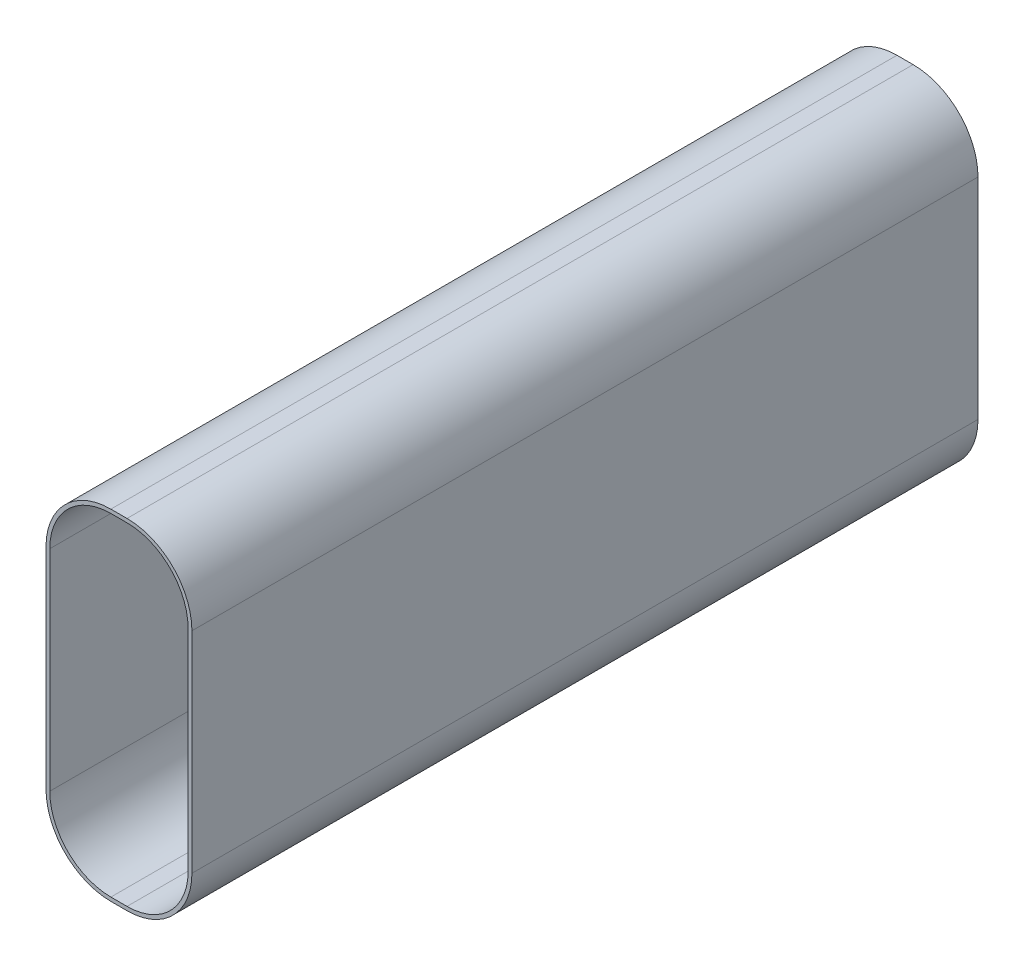
ISO-10303-21;
HEADER;
FILE_DESCRIPTION(('STEP AP214'),'2;1');
FILE_NAME('part.step','',(''),(''),'','','');
FILE_SCHEMA(('AUTOMOTIVE_DESIGN { 1 0 10303 214 1 1 1 1 }'));
ENDSEC;
DATA;
#1=APPLICATION_CONTEXT('core data for automotive mechanical design processes');
#2=APPLICATION_PROTOCOL_DEFINITION('international standard','automotive_design',2000,#1);
#3=PRODUCT_CONTEXT('',#1,'mechanical');
#4=PRODUCT('Part','Part','',(#3));
#5=PRODUCT_RELATED_PRODUCT_CATEGORY('part','',(#4));
#6=PRODUCT_DEFINITION_FORMATION('','',#4);
#7=PRODUCT_DEFINITION_CONTEXT('part definition',#1,'design');
#8=PRODUCT_DEFINITION('design','',#6,#7);
#9=PRODUCT_DEFINITION_SHAPE('','',#8);
#10=(LENGTH_UNIT() NAMED_UNIT(*) SI_UNIT(.MILLI.,.METRE.));
#11=(NAMED_UNIT(*) PLANE_ANGLE_UNIT() SI_UNIT($,.RADIAN.));
#12=(NAMED_UNIT(*) SI_UNIT($,.STERADIAN.) SOLID_ANGLE_UNIT());
#13=UNCERTAINTY_MEASURE_WITH_UNIT(LENGTH_MEASURE(1.E-05),#10,'distance_accuracy_value','');
#14=(GEOMETRIC_REPRESENTATION_CONTEXT(3) GLOBAL_UNCERTAINTY_ASSIGNED_CONTEXT((#13)) GLOBAL_UNIT_ASSIGNED_CONTEXT((#10,
#11,#12)) REPRESENTATION_CONTEXT('',''));
#15=CARTESIAN_POINT('',(0.,0.,0.));
#16=DIRECTION('',(0.,0.,1.));
#17=DIRECTION('',(1.,0.,0.));
#18=AXIS2_PLACEMENT_3D('',#15,#16,#17);
#19=CARTESIAN_POINT('',(0.380999999999987,-4.95299999999999,37.084));
#20=DIRECTION('',(0.,0.,-1.));
#21=DIRECTION('',(-1.,0.,0.));
#22=AXIS2_PLACEMENT_3D('',#19,#20,#21);
#23=PLANE('',#22);
#24=CARTESIAN_POINT('',(0.380999999999987,-4.95299999999999,37.084));
#25=DIRECTION('',(0.,0.,1.));
#26=DIRECTION('',(-1.,0.,0.));
#27=AXIS2_PLACEMENT_3D('',#24,#25,#26);
#28=CIRCLE('',#27,3.06070000000001);
#29=CARTESIAN_POINT('',(0.380999999999988,-8.0137,37.084));
#30=VERTEX_POINT('',#29);
#31=CARTESIAN_POINT('',(3.4417,-4.95299999999999,37.084));
#32=VERTEX_POINT('',#31);
#33=EDGE_CURVE('E217',#30,#32,#28,.T.);
#34=ORIENTED_EDGE('',*,*,#33,.T.);
#35=DIRECTION('',(0.,1.,0.));
#36=VECTOR('',#35,1.);
#37=CARTESIAN_POINT('',(3.4417,4.95299999999999,37.084));
#38=LINE('',#37,#36);
#39=CARTESIAN_POINT('',(3.4417,4.95299999999999,37.084));
#40=VERTEX_POINT('',#39);
#41=EDGE_CURVE('E220',#32,#40,#38,.T.);
#42=ORIENTED_EDGE('',*,*,#41,.T.);
#43=CARTESIAN_POINT('',(0.380999999999987,4.95299999999999,37.084));
#44=DIRECTION('',(0.,0.,1.));
#45=DIRECTION('',(-1.,0.,0.));
#46=AXIS2_PLACEMENT_3D('',#43,#44,#45);
#47=CIRCLE('',#46,3.06070000000001);
#48=CARTESIAN_POINT('',(0.380999999999988,8.0137,37.084));
#49=VERTEX_POINT('',#48);
#50=EDGE_CURVE('E223',#40,#49,#47,.T.);
#51=ORIENTED_EDGE('',*,*,#50,.T.);
#52=DIRECTION('',(-1.,0.,0.));
#53=VECTOR('',#52,1.);
#54=CARTESIAN_POINT('',(0.380999999999988,8.0137,37.084));
#55=LINE('',#54,#53);
#56=CARTESIAN_POINT('',(-0.380999999999988,8.0137,37.084));
#57=VERTEX_POINT('',#56);
#58=EDGE_CURVE('E225',#49,#57,#55,.T.);
#59=ORIENTED_EDGE('',*,*,#58,.T.);
#60=CARTESIAN_POINT('',(-0.380999999999987,4.95299999999999,37.084));
#61=DIRECTION('',(0.,0.,1.));
#62=DIRECTION('',(1.,0.,0.));
#63=AXIS2_PLACEMENT_3D('',#60,#61,#62);
#64=CIRCLE('',#63,3.06070000000001);
#65=CARTESIAN_POINT('',(-3.4417,4.95299999999999,37.084));
#66=VERTEX_POINT('',#65);
#67=EDGE_CURVE('E227',#57,#66,#64,.T.);
#68=ORIENTED_EDGE('',*,*,#67,.T.);
#69=DIRECTION('',(0.,-1.,0.));
#70=VECTOR('',#69,1.);
#71=CARTESIAN_POINT('',(-3.4417,4.95299999999999,37.084));
#72=LINE('',#71,#70);
#73=CARTESIAN_POINT('',(-3.4417,-4.95299999999999,37.084));
#74=VERTEX_POINT('',#73);
#75=EDGE_CURVE('E229',#66,#74,#72,.T.);
#76=ORIENTED_EDGE('',*,*,#75,.T.);
#77=CARTESIAN_POINT('',(-0.380999999999987,-4.95299999999999,37.084));
#78=DIRECTION('',(0.,0.,1.));
#79=DIRECTION('',(1.,0.,0.));
#80=AXIS2_PLACEMENT_3D('',#77,#78,#79);
#81=CIRCLE('',#80,3.06070000000001);
#82=CARTESIAN_POINT('',(-0.380999999999988,-8.0137,37.084));
#83=VERTEX_POINT('',#82);
#84=EDGE_CURVE('E231',#74,#83,#81,.T.);
#85=ORIENTED_EDGE('',*,*,#84,.T.);
#86=DIRECTION('',(1.,0.,0.));
#87=VECTOR('',#86,1.);
#88=CARTESIAN_POINT('',(-0.380999999999988,-8.0137,37.084));
#89=LINE('',#88,#87);
#90=EDGE_CURVE('E233',#83,#30,#89,.T.);
#91=ORIENTED_EDGE('',*,*,#90,.T.);
#92=EDGE_LOOP('',(#34,#42,#51,#59,#68,#76,#85,#91));
#93=FACE_BOUND('',#92,.T.);
#94=CARTESIAN_POINT('',(0.380999999999987,4.95299999999999,37.084));
#95=DIRECTION('',(0.,0.,1.));
#96=DIRECTION('',(-1.,0.,0.));
#97=AXIS2_PLACEMENT_3D('',#94,#95,#96);
#98=CIRCLE('',#97,2.88290000000001);
#99=CARTESIAN_POINT('',(3.2639,4.95299999999999,37.084));
#100=VERTEX_POINT('',#99);
#101=CARTESIAN_POINT('',(0.380999999999988,7.8359,37.084));
#102=VERTEX_POINT('',#101);
#103=EDGE_CURVE('E152',#100,#102,#98,.T.);
#104=ORIENTED_EDGE('',*,*,#103,.F.);
#105=DIRECTION('',(0.,1.,0.));
#106=VECTOR('',#105,1.);
#107=CARTESIAN_POINT('',(3.2639,4.95299999999999,37.084));
#108=LINE('',#107,#106);
#109=CARTESIAN_POINT('',(3.2639,-4.95299999999999,37.084));
#110=VERTEX_POINT('',#109);
#111=EDGE_CURVE('E185',#110,#100,#108,.T.);
#112=ORIENTED_EDGE('',*,*,#111,.F.);
#113=CARTESIAN_POINT('',(0.380999999999987,-4.95299999999999,37.084));
#114=DIRECTION('',(0.,0.,1.));
#115=DIRECTION('',(-1.,0.,0.));
#116=AXIS2_PLACEMENT_3D('',#113,#114,#115);
#117=CIRCLE('',#116,2.88290000000001);
#118=CARTESIAN_POINT('',(0.380999999999988,-7.8359,37.084));
#119=VERTEX_POINT('',#118);
#120=EDGE_CURVE('E183',#119,#110,#117,.T.);
#121=ORIENTED_EDGE('',*,*,#120,.F.);
#122=DIRECTION('',(1.,0.,0.));
#123=VECTOR('',#122,1.);
#124=CARTESIAN_POINT('',(-0.380999999999988,-7.8359,37.084));
#125=LINE('',#124,#123);
#126=CARTESIAN_POINT('',(-0.380999999999988,-7.8359,37.084));
#127=VERTEX_POINT('',#126);
#128=EDGE_CURVE('E181',#127,#119,#125,.T.);
#129=ORIENTED_EDGE('',*,*,#128,.F.);
#130=CARTESIAN_POINT('',(-0.380999999999987,-4.95299999999999,37.084));
#131=DIRECTION('',(0.,0.,1.));
#132=DIRECTION('',(1.,0.,0.));
#133=AXIS2_PLACEMENT_3D('',#130,#131,#132);
#134=CIRCLE('',#133,2.88290000000001);
#135=CARTESIAN_POINT('',(-3.2639,-4.95299999999999,37.084));
#136=VERTEX_POINT('',#135);
#137=EDGE_CURVE('E179',#136,#127,#134,.T.);
#138=ORIENTED_EDGE('',*,*,#137,.F.);
#139=DIRECTION('',(0.,-1.,0.));
#140=VECTOR('',#139,1.);
#141=CARTESIAN_POINT('',(-3.2639,4.95299999999999,37.084));
#142=LINE('',#141,#140);
#143=CARTESIAN_POINT('',(-3.2639,4.95299999999999,37.084));
#144=VERTEX_POINT('',#143);
#145=EDGE_CURVE('E175',#144,#136,#142,.T.);
#146=ORIENTED_EDGE('',*,*,#145,.F.);
#147=CARTESIAN_POINT('',(-0.380999999999987,4.95299999999999,37.084));
#148=DIRECTION('',(0.,0.,1.));
#149=DIRECTION('',(1.,0.,0.));
#150=AXIS2_PLACEMENT_3D('',#147,#148,#149);
#151=CIRCLE('',#150,2.88290000000001);
#152=CARTESIAN_POINT('',(-0.380999999999988,7.8359,37.084));
#153=VERTEX_POINT('',#152);
#154=EDGE_CURVE('E173',#153,#144,#151,.T.);
#155=ORIENTED_EDGE('',*,*,#154,.F.);
#156=DIRECTION('',(-1.,0.,0.));
#157=VECTOR('',#156,1.);
#158=CARTESIAN_POINT('',(0.380999999999988,7.8359,37.084));
#159=LINE('',#158,#157);
#160=EDGE_CURVE('E160',#102,#153,#159,.T.);
#161=ORIENTED_EDGE('',*,*,#160,.F.);
#162=EDGE_LOOP('',(#104,#112,#121,#129,#138,#146,#155,#161));
#163=FACE_BOUND('',#162,.T.);
#164=ADVANCED_FACE('F39',(#93,#163),#23,.F.);
#165=CARTESIAN_POINT('',(0.380999999999987,-4.95299999999999,0.));
#166=DIRECTION('',(0.,0.,-1.));
#167=DIRECTION('',(-1.,0.,0.));
#168=AXIS2_PLACEMENT_3D('',#165,#166,#167);
#169=PLANE('',#168);
#170=CARTESIAN_POINT('',(0.380999999999987,-4.95299999999999,0.));
#171=DIRECTION('',(0.,0.,1.));
#172=DIRECTION('',(-1.,0.,0.));
#173=AXIS2_PLACEMENT_3D('',#170,#171,#172);
#174=CIRCLE('',#173,3.06070000000001);
#175=CARTESIAN_POINT('',(0.380999999999988,-8.0137,0.));
#176=VERTEX_POINT('',#175);
#177=CARTESIAN_POINT('',(3.4417,-4.95299999999999,0.));
#178=VERTEX_POINT('',#177);
#179=EDGE_CURVE('E168',#176,#178,#174,.T.);
#180=ORIENTED_EDGE('',*,*,#179,.F.);
#181=DIRECTION('',(1.,0.,0.));
#182=VECTOR('',#181,1.);
#183=CARTESIAN_POINT('',(-0.380999999999988,-8.0137,0.));
#184=LINE('',#183,#182);
#185=CARTESIAN_POINT('',(-0.380999999999988,-8.0137,0.));
#186=VERTEX_POINT('',#185);
#187=EDGE_CURVE('E221',#186,#176,#184,.T.);
#188=ORIENTED_EDGE('',*,*,#187,.F.);
#189=CARTESIAN_POINT('',(-0.380999999999987,-4.95299999999999,0.));
#190=DIRECTION('',(0.,0.,1.));
#191=DIRECTION('',(1.,0.,0.));
#192=AXIS2_PLACEMENT_3D('',#189,#190,#191);
#193=CIRCLE('',#192,3.06070000000001);
#194=CARTESIAN_POINT('',(-3.4417,-4.95299999999999,0.));
#195=VERTEX_POINT('',#194);
#196=EDGE_CURVE('E248',#195,#186,#193,.T.);
#197=ORIENTED_EDGE('',*,*,#196,.F.);
#198=DIRECTION('',(0.,-1.,0.));
#199=VECTOR('',#198,1.);
#200=CARTESIAN_POINT('',(-3.4417,4.95299999999999,0.));
#201=LINE('',#200,#199);
#202=CARTESIAN_POINT('',(-3.4417,4.95299999999999,0.));
#203=VERTEX_POINT('',#202);
#204=EDGE_CURVE('E246',#203,#195,#201,.T.);
#205=ORIENTED_EDGE('',*,*,#204,.F.);
#206=CARTESIAN_POINT('',(-0.380999999999987,4.95299999999999,0.));
#207=DIRECTION('',(0.,0.,1.));
#208=DIRECTION('',(1.,0.,0.));
#209=AXIS2_PLACEMENT_3D('',#206,#207,#208);
#210=CIRCLE('',#209,3.06070000000001);
#211=CARTESIAN_POINT('',(-0.380999999999988,8.0137,0.));
#212=VERTEX_POINT('',#211);
#213=EDGE_CURVE('E244',#212,#203,#210,.T.);
#214=ORIENTED_EDGE('',*,*,#213,.F.);
#215=DIRECTION('',(-1.,0.,0.));
#216=VECTOR('',#215,1.);
#217=CARTESIAN_POINT('',(0.380999999999988,8.0137,0.));
#218=LINE('',#217,#216);
#219=CARTESIAN_POINT('',(0.380999999999988,8.0137,0.));
#220=VERTEX_POINT('',#219);
#221=EDGE_CURVE('E242',#220,#212,#218,.T.);
#222=ORIENTED_EDGE('',*,*,#221,.F.);
#223=CARTESIAN_POINT('',(0.380999999999987,4.95299999999999,0.));
#224=DIRECTION('',(0.,0.,1.));
#225=DIRECTION('',(-1.,0.,0.));
#226=AXIS2_PLACEMENT_3D('',#223,#224,#225);
#227=CIRCLE('',#226,3.06070000000001);
#228=CARTESIAN_POINT('',(3.4417,4.95299999999999,0.));
#229=VERTEX_POINT('',#228);
#230=EDGE_CURVE('E240',#229,#220,#227,.T.);
#231=ORIENTED_EDGE('',*,*,#230,.F.);
#232=DIRECTION('',(0.,1.,0.));
#233=VECTOR('',#232,1.);
#234=CARTESIAN_POINT('',(3.4417,4.95299999999999,0.));
#235=LINE('',#234,#233);
#236=EDGE_CURVE('E238',#178,#229,#235,.T.);
#237=ORIENTED_EDGE('',*,*,#236,.F.);
#238=EDGE_LOOP('',(#180,#188,#197,#205,#214,#222,#231,#237));
#239=FACE_BOUND('',#238,.T.);
#240=DIRECTION('',(0.,1.,0.));
#241=VECTOR('',#240,1.);
#242=CARTESIAN_POINT('',(3.2639,4.95299999999999,0.));
#243=LINE('',#242,#241);
#244=CARTESIAN_POINT('',(3.2639,-4.95299999999999,0.));
#245=VERTEX_POINT('',#244);
#246=CARTESIAN_POINT('',(3.2639,4.95299999999999,0.));
#247=VERTEX_POINT('',#246);
#248=EDGE_CURVE('E161',#245,#247,#243,.T.);
#249=ORIENTED_EDGE('',*,*,#248,.T.);
#250=CARTESIAN_POINT('',(0.380999999999987,4.95299999999999,0.));
#251=DIRECTION('',(0.,0.,1.));
#252=DIRECTION('',(-1.,0.,0.));
#253=AXIS2_PLACEMENT_3D('',#250,#251,#252);
#254=CIRCLE('',#253,2.88290000000001);
#255=CARTESIAN_POINT('',(0.380999999999988,7.8359,0.));
#256=VERTEX_POINT('',#255);
#257=EDGE_CURVE('E62',#247,#256,#254,.T.);
#258=ORIENTED_EDGE('',*,*,#257,.T.);
#259=DIRECTION('',(-1.,0.,0.));
#260=VECTOR('',#259,1.);
#261=CARTESIAN_POINT('',(0.380999999999988,7.8359,0.));
#262=LINE('',#261,#260);
#263=CARTESIAN_POINT('',(-0.380999999999988,7.8359,0.));
#264=VERTEX_POINT('',#263);
#265=EDGE_CURVE('E167',#256,#264,#262,.T.);
#266=ORIENTED_EDGE('',*,*,#265,.T.);
#267=CARTESIAN_POINT('',(-0.380999999999987,4.95299999999999,0.));
#268=DIRECTION('',(0.,0.,1.));
#269=DIRECTION('',(1.,0.,0.));
#270=AXIS2_PLACEMENT_3D('',#267,#268,#269);
#271=CIRCLE('',#270,2.88290000000001);
#272=CARTESIAN_POINT('',(-3.2639,4.95299999999999,0.));
#273=VERTEX_POINT('',#272);
#274=EDGE_CURVE('E189',#264,#273,#271,.T.);
#275=ORIENTED_EDGE('',*,*,#274,.T.);
#276=DIRECTION('',(0.,-1.,0.));
#277=VECTOR('',#276,1.);
#278=CARTESIAN_POINT('',(-3.2639,4.95299999999999,0.));
#279=LINE('',#278,#277);
#280=CARTESIAN_POINT('',(-3.2639,-4.95299999999999,0.));
#281=VERTEX_POINT('',#280);
#282=EDGE_CURVE('E192',#273,#281,#279,.T.);
#283=ORIENTED_EDGE('',*,*,#282,.T.);
#284=CARTESIAN_POINT('',(-0.380999999999987,-4.95299999999999,0.));
#285=DIRECTION('',(0.,0.,1.));
#286=DIRECTION('',(1.,0.,0.));
#287=AXIS2_PLACEMENT_3D('',#284,#285,#286);
#288=CIRCLE('',#287,2.88290000000001);
#289=CARTESIAN_POINT('',(-0.380999999999988,-7.8359,0.));
#290=VERTEX_POINT('',#289);
#291=EDGE_CURVE('E195',#281,#290,#288,.T.);
#292=ORIENTED_EDGE('',*,*,#291,.T.);
#293=DIRECTION('',(1.,0.,0.));
#294=VECTOR('',#293,1.);
#295=CARTESIAN_POINT('',(-0.380999999999988,-7.8359,0.));
#296=LINE('',#295,#294);
#297=CARTESIAN_POINT('',(0.380999999999988,-7.8359,0.));
#298=VERTEX_POINT('',#297);
#299=EDGE_CURVE('E198',#290,#298,#296,.T.);
#300=ORIENTED_EDGE('',*,*,#299,.T.);
#301=CARTESIAN_POINT('',(0.380999999999987,-4.95299999999999,0.));
#302=DIRECTION('',(0.,0.,1.));
#303=DIRECTION('',(-1.,0.,0.));
#304=AXIS2_PLACEMENT_3D('',#301,#302,#303);
#305=CIRCLE('',#304,2.88290000000001);
#306=EDGE_CURVE('E201',#298,#245,#305,.T.);
#307=ORIENTED_EDGE('',*,*,#306,.T.);
#308=EDGE_LOOP('',(#249,#258,#266,#275,#283,#292,#300,#307));
#309=FACE_BOUND('',#308,.T.);
#310=ADVANCED_FACE('F278',(#239,#309),#169,.T.);
#311=CARTESIAN_POINT('',(0.380999999999987,-4.95299999999999,37.084));
#312=DIRECTION('',(0.,0.,-1.));
#313=DIRECTION('',(-1.,0.,0.));
#314=AXIS2_PLACEMENT_3D('',#311,#312,#313);
#315=CYLINDRICAL_SURFACE('',#314,3.06070000000001);
#316=ORIENTED_EDGE('',*,*,#179,.T.);
#317=DIRECTION('',(0.,0.,-1.));
#318=VECTOR('',#317,1.);
#319=CARTESIAN_POINT('',(3.4417,-4.95299999999999,37.084));
#320=LINE('',#319,#318);
#321=EDGE_CURVE('E11',#32,#178,#320,.T.);
#322=ORIENTED_EDGE('',*,*,#321,.F.);
#323=ORIENTED_EDGE('',*,*,#33,.F.);
#324=DIRECTION('',(0.,0.,-1.));
#325=VECTOR('',#324,1.);
#326=CARTESIAN_POINT('',(0.380999999999988,-8.0137,37.084));
#327=LINE('',#326,#325);
#328=EDGE_CURVE('E235',#30,#176,#327,.T.);
#329=ORIENTED_EDGE('',*,*,#328,.T.);
#330=EDGE_LOOP('',(#316,#322,#323,#329));
#331=FACE_BOUND('',#330,.T.);
#332=ADVANCED_FACE('F41',(#331),#315,.T.);
#333=CARTESIAN_POINT('',(3.4417,4.95299999999999,37.084));
#334=DIRECTION('',(-1.,0.,0.));
#335=DIRECTION('',(0.,0.,1.));
#336=AXIS2_PLACEMENT_3D('',#333,#334,#335);
#337=PLANE('',#336);
#338=ORIENTED_EDGE('',*,*,#236,.T.);
#339=DIRECTION('',(0.,0.,-1.));
#340=VECTOR('',#339,1.);
#341=CARTESIAN_POINT('',(3.4417,4.95299999999999,37.084));
#342=LINE('',#341,#340);
#343=EDGE_CURVE('E47',#40,#229,#342,.T.);
#344=ORIENTED_EDGE('',*,*,#343,.F.);
#345=ORIENTED_EDGE('',*,*,#41,.F.);
#346=ORIENTED_EDGE('',*,*,#321,.T.);
#347=EDGE_LOOP('',(#338,#344,#345,#346));
#348=FACE_BOUND('',#347,.T.);
#349=ADVANCED_FACE('F295',(#348),#337,.F.);
#350=CARTESIAN_POINT('',(0.380999999999987,4.95299999999999,37.084));
#351=DIRECTION('',(0.,0.,-1.));
#352=DIRECTION('',(-1.,0.,0.));
#353=AXIS2_PLACEMENT_3D('',#350,#351,#352);
#354=CYLINDRICAL_SURFACE('',#353,3.06070000000001);
#355=ORIENTED_EDGE('',*,*,#230,.T.);
#356=DIRECTION('',(0.,0.,-1.));
#357=VECTOR('',#356,1.);
#358=CARTESIAN_POINT('',(0.380999999999988,8.0137,37.084));
#359=LINE('',#358,#357);
#360=EDGE_CURVE('E265',#49,#220,#359,.T.);
#361=ORIENTED_EDGE('',*,*,#360,.F.);
#362=ORIENTED_EDGE('',*,*,#50,.F.);
#363=ORIENTED_EDGE('',*,*,#343,.T.);
#364=EDGE_LOOP('',(#355,#361,#362,#363));
#365=FACE_BOUND('',#364,.T.);
#366=ADVANCED_FACE('F272',(#365),#354,.T.);
#367=CARTESIAN_POINT('',(0.380999999999988,8.0137,37.084));
#368=DIRECTION('',(0.,-1.,0.));
#369=DIRECTION('',(0.,0.,-1.));
#370=AXIS2_PLACEMENT_3D('',#367,#368,#369);
#371=PLANE('',#370);
#372=ORIENTED_EDGE('',*,*,#221,.T.);
#373=DIRECTION('',(0.,0.,-1.));
#374=VECTOR('',#373,1.);
#375=CARTESIAN_POINT('',(-0.380999999999988,8.0137,37.084));
#376=LINE('',#375,#374);
#377=EDGE_CURVE('E262',#57,#212,#376,.T.);
#378=ORIENTED_EDGE('',*,*,#377,.F.);
#379=ORIENTED_EDGE('',*,*,#58,.F.);
#380=ORIENTED_EDGE('',*,*,#360,.T.);
#381=EDGE_LOOP('',(#372,#378,#379,#380));
#382=FACE_BOUND('',#381,.T.);
#383=ADVANCED_FACE('F284',(#382),#371,.F.);
#384=CARTESIAN_POINT('',(-0.380999999999987,4.95299999999999,37.084));
#385=DIRECTION('',(0.,0.,-1.));
#386=DIRECTION('',(-1.,0.,0.));
#387=AXIS2_PLACEMENT_3D('',#384,#385,#386);
#388=CYLINDRICAL_SURFACE('',#387,3.06070000000001);
#389=ORIENTED_EDGE('',*,*,#213,.T.);
#390=DIRECTION('',(0.,0.,-1.));
#391=VECTOR('',#390,1.);
#392=CARTESIAN_POINT('',(-3.4417,4.95299999999999,37.084));
#393=LINE('',#392,#391);
#394=EDGE_CURVE('E259',#66,#203,#393,.T.);
#395=ORIENTED_EDGE('',*,*,#394,.F.);
#396=ORIENTED_EDGE('',*,*,#67,.F.);
#397=ORIENTED_EDGE('',*,*,#377,.T.);
#398=EDGE_LOOP('',(#389,#395,#396,#397));
#399=FACE_BOUND('',#398,.T.);
#400=ADVANCED_FACE('F288',(#399),#388,.T.);
#401=CARTESIAN_POINT('',(-3.4417,4.95299999999999,37.084));
#402=DIRECTION('',(1.,0.,0.));
#403=DIRECTION('',(0.,0.,-1.));
#404=AXIS2_PLACEMENT_3D('',#401,#402,#403);
#405=PLANE('',#404);
#406=ORIENTED_EDGE('',*,*,#204,.T.);
#407=DIRECTION('',(0.,0.,-1.));
#408=VECTOR('',#407,1.);
#409=CARTESIAN_POINT('',(-3.4417,-4.95299999999999,37.084));
#410=LINE('',#409,#408);
#411=EDGE_CURVE('E256',#74,#195,#410,.T.);
#412=ORIENTED_EDGE('',*,*,#411,.F.);
#413=ORIENTED_EDGE('',*,*,#75,.F.);
#414=ORIENTED_EDGE('',*,*,#394,.T.);
#415=EDGE_LOOP('',(#406,#412,#413,#414));
#416=FACE_BOUND('',#415,.T.);
#417=ADVANCED_FACE('F308',(#416),#405,.F.);
#418=CARTESIAN_POINT('',(-0.380999999999987,-4.95299999999999,37.084));
#419=DIRECTION('',(0.,0.,-1.));
#420=DIRECTION('',(-1.,0.,0.));
#421=AXIS2_PLACEMENT_3D('',#418,#419,#420);
#422=CYLINDRICAL_SURFACE('',#421,3.06070000000001);
#423=ORIENTED_EDGE('',*,*,#196,.T.);
#424=DIRECTION('',(0.,0.,-1.));
#425=VECTOR('',#424,1.);
#426=CARTESIAN_POINT('',(-0.380999999999988,-8.0137,37.084));
#427=LINE('',#426,#425);
#428=EDGE_CURVE('E253',#83,#186,#427,.T.);
#429=ORIENTED_EDGE('',*,*,#428,.F.);
#430=ORIENTED_EDGE('',*,*,#84,.F.);
#431=ORIENTED_EDGE('',*,*,#411,.T.);
#432=EDGE_LOOP('',(#423,#429,#430,#431));
#433=FACE_BOUND('',#432,.T.);
#434=ADVANCED_FACE('F306',(#433),#422,.T.);
#435=CARTESIAN_POINT('',(-0.380999999999988,-8.0137,37.084));
#436=DIRECTION('',(0.,1.,0.));
#437=DIRECTION('',(0.,0.,1.));
#438=AXIS2_PLACEMENT_3D('',#435,#436,#437);
#439=PLANE('',#438);
#440=ORIENTED_EDGE('',*,*,#187,.T.);
#441=ORIENTED_EDGE('',*,*,#328,.F.);
#442=ORIENTED_EDGE('',*,*,#90,.F.);
#443=ORIENTED_EDGE('',*,*,#428,.T.);
#444=EDGE_LOOP('',(#440,#441,#442,#443));
#445=FACE_BOUND('',#444,.T.);
#446=ADVANCED_FACE('F301',(#445),#439,.F.);
#447=CARTESIAN_POINT('',(0.380999999999987,4.95299999999999,37.084));
#448=DIRECTION('',(0.,0.,-1.));
#449=DIRECTION('',(-1.,0.,0.));
#450=AXIS2_PLACEMENT_3D('',#447,#448,#449);
#451=CYLINDRICAL_SURFACE('',#450,2.88290000000001);
#452=ORIENTED_EDGE('',*,*,#257,.F.);
#453=DIRECTION('',(0.,0.,-1.));
#454=VECTOR('',#453,1.);
#455=CARTESIAN_POINT('',(3.2639,4.95299999999999,37.084));
#456=LINE('',#455,#454);
#457=EDGE_CURVE('E156',#100,#247,#456,.T.);
#458=ORIENTED_EDGE('',*,*,#457,.F.);
#459=ORIENTED_EDGE('',*,*,#103,.T.);
#460=DIRECTION('',(0.,0.,-1.));
#461=VECTOR('',#460,1.);
#462=CARTESIAN_POINT('',(0.380999999999988,7.8359,37.084));
#463=LINE('',#462,#461);
#464=EDGE_CURVE('E155',#102,#256,#463,.T.);
#465=ORIENTED_EDGE('',*,*,#464,.T.);
#466=EDGE_LOOP('',(#452,#458,#459,#465));
#467=FACE_BOUND('',#466,.T.);
#468=ADVANCED_FACE('F154',(#467),#451,.F.);
#469=CARTESIAN_POINT('',(0.380999999999988,7.8359,37.084));
#470=DIRECTION('',(0.,-1.,0.));
#471=DIRECTION('',(0.,0.,-1.));
#472=AXIS2_PLACEMENT_3D('',#469,#470,#471);
#473=PLANE('',#472);
#474=ORIENTED_EDGE('',*,*,#265,.F.);
#475=ORIENTED_EDGE('',*,*,#464,.F.);
#476=ORIENTED_EDGE('',*,*,#160,.T.);
#477=DIRECTION('',(0.,0.,-1.));
#478=VECTOR('',#477,1.);
#479=CARTESIAN_POINT('',(-0.380999999999988,7.8359,37.084));
#480=LINE('',#479,#478);
#481=EDGE_CURVE('E169',#153,#264,#480,.T.);
#482=ORIENTED_EDGE('',*,*,#481,.T.);
#483=EDGE_LOOP('',(#474,#475,#476,#482));
#484=FACE_BOUND('',#483,.T.);
#485=ADVANCED_FACE('F164',(#484),#473,.T.);
#486=CARTESIAN_POINT('',(-0.380999999999987,4.95299999999999,37.084));
#487=DIRECTION('',(0.,0.,-1.));
#488=DIRECTION('',(-1.,0.,0.));
#489=AXIS2_PLACEMENT_3D('',#486,#487,#488);
#490=CYLINDRICAL_SURFACE('',#489,2.88290000000001);
#491=ORIENTED_EDGE('',*,*,#274,.F.);
#492=ORIENTED_EDGE('',*,*,#481,.F.);
#493=ORIENTED_EDGE('',*,*,#154,.T.);
#494=DIRECTION('',(0.,0.,-1.));
#495=VECTOR('',#494,1.);
#496=CARTESIAN_POINT('',(-3.2639,4.95299999999999,37.084));
#497=LINE('',#496,#495);
#498=EDGE_CURVE('E214',#144,#273,#497,.T.);
#499=ORIENTED_EDGE('',*,*,#498,.T.);
#500=EDGE_LOOP('',(#491,#492,#493,#499));
#501=FACE_BOUND('',#500,.T.);
#502=ADVANCED_FACE('F333',(#501),#490,.F.);
#503=CARTESIAN_POINT('',(-3.2639,4.95299999999999,37.084));
#504=DIRECTION('',(1.,0.,0.));
#505=DIRECTION('',(0.,1.,0.));
#506=AXIS2_PLACEMENT_3D('',#503,#504,#505);
#507=PLANE('',#506);
#508=ORIENTED_EDGE('',*,*,#282,.F.);
#509=ORIENTED_EDGE('',*,*,#498,.F.);
#510=ORIENTED_EDGE('',*,*,#145,.T.);
#511=DIRECTION('',(0.,0.,-1.));
#512=VECTOR('',#511,1.);
#513=CARTESIAN_POINT('',(-3.2639,-4.95299999999999,37.084));
#514=LINE('',#513,#512);
#515=EDGE_CURVE('E212',#136,#281,#514,.T.);
#516=ORIENTED_EDGE('',*,*,#515,.T.);
#517=EDGE_LOOP('',(#508,#509,#510,#516));
#518=FACE_BOUND('',#517,.T.);
#519=ADVANCED_FACE('F337',(#518),#507,.T.);
#520=CARTESIAN_POINT('',(-0.380999999999987,-4.95299999999999,37.084));
#521=DIRECTION('',(0.,0.,-1.));
#522=DIRECTION('',(-1.,0.,0.));
#523=AXIS2_PLACEMENT_3D('',#520,#521,#522);
#524=CYLINDRICAL_SURFACE('',#523,2.88290000000001);
#525=ORIENTED_EDGE('',*,*,#291,.F.);
#526=ORIENTED_EDGE('',*,*,#515,.F.);
#527=ORIENTED_EDGE('',*,*,#137,.T.);
#528=DIRECTION('',(0.,0.,-1.));
#529=VECTOR('',#528,1.);
#530=CARTESIAN_POINT('',(-0.380999999999988,-7.8359,37.084));
#531=LINE('',#530,#529);
#532=EDGE_CURVE('E210',#127,#290,#531,.T.);
#533=ORIENTED_EDGE('',*,*,#532,.T.);
#534=EDGE_LOOP('',(#525,#526,#527,#533));
#535=FACE_BOUND('',#534,.T.);
#536=ADVANCED_FACE('F343',(#535),#524,.F.);
#537=CARTESIAN_POINT('',(-0.380999999999988,-7.8359,37.084));
#538=DIRECTION('',(0.,1.,0.));
#539=DIRECTION('',(0.,0.,1.));
#540=AXIS2_PLACEMENT_3D('',#537,#538,#539);
#541=PLANE('',#540);
#542=ORIENTED_EDGE('',*,*,#299,.F.);
#543=ORIENTED_EDGE('',*,*,#532,.F.);
#544=ORIENTED_EDGE('',*,*,#128,.T.);
#545=DIRECTION('',(0.,0.,-1.));
#546=VECTOR('',#545,1.);
#547=CARTESIAN_POINT('',(0.380999999999988,-7.8359,37.084));
#548=LINE('',#547,#546);
#549=EDGE_CURVE('E208',#119,#298,#548,.T.);
#550=ORIENTED_EDGE('',*,*,#549,.T.);
#551=EDGE_LOOP('',(#542,#543,#544,#550));
#552=FACE_BOUND('',#551,.T.);
#553=ADVANCED_FACE('F347',(#552),#541,.T.);
#554=CARTESIAN_POINT('',(0.380999999999987,-4.95299999999999,37.084));
#555=DIRECTION('',(0.,0.,-1.));
#556=DIRECTION('',(-1.,0.,0.));
#557=AXIS2_PLACEMENT_3D('',#554,#555,#556);
#558=CYLINDRICAL_SURFACE('',#557,2.88290000000001);
#559=ORIENTED_EDGE('',*,*,#306,.F.);
#560=ORIENTED_EDGE('',*,*,#549,.F.);
#561=ORIENTED_EDGE('',*,*,#120,.T.);
#562=DIRECTION('',(0.,0.,-1.));
#563=VECTOR('',#562,1.);
#564=CARTESIAN_POINT('',(3.2639,-4.95299999999999,37.084));
#565=LINE('',#564,#563);
#566=EDGE_CURVE('E54',#110,#245,#565,.T.);
#567=ORIENTED_EDGE('',*,*,#566,.T.);
#568=EDGE_LOOP('',(#559,#560,#561,#567));
#569=FACE_BOUND('',#568,.T.);
#570=ADVANCED_FACE('F351',(#569),#558,.F.);
#571=CARTESIAN_POINT('',(3.2639,4.95299999999999,37.084));
#572=DIRECTION('',(-1.,0.,0.));
#573=DIRECTION('',(0.,-1.,0.));
#574=AXIS2_PLACEMENT_3D('',#571,#572,#573);
#575=PLANE('',#574);
#576=ORIENTED_EDGE('',*,*,#248,.F.);
#577=ORIENTED_EDGE('',*,*,#566,.F.);
#578=ORIENTED_EDGE('',*,*,#111,.T.);
#579=ORIENTED_EDGE('',*,*,#457,.T.);
#580=EDGE_LOOP('',(#576,#577,#578,#579));
#581=FACE_BOUND('',#580,.T.);
#582=ADVANCED_FACE('F355',(#581),#575,.T.);
#583=CLOSED_SHELL('',(#164,#310,#332,#349,#366,#383,#400,#417,#434,#446,#468,#485,#502,#519,
#536,#553,#570,#582));
#584=MANIFOLD_SOLID_BREP('B2',#583);
#585=ADVANCED_BREP_SHAPE_REPRESENTATION('',(#18,#584),#14);
#586=SHAPE_DEFINITION_REPRESENTATION(#9,#585);
ENDSEC;
END-ISO-10303-21;
